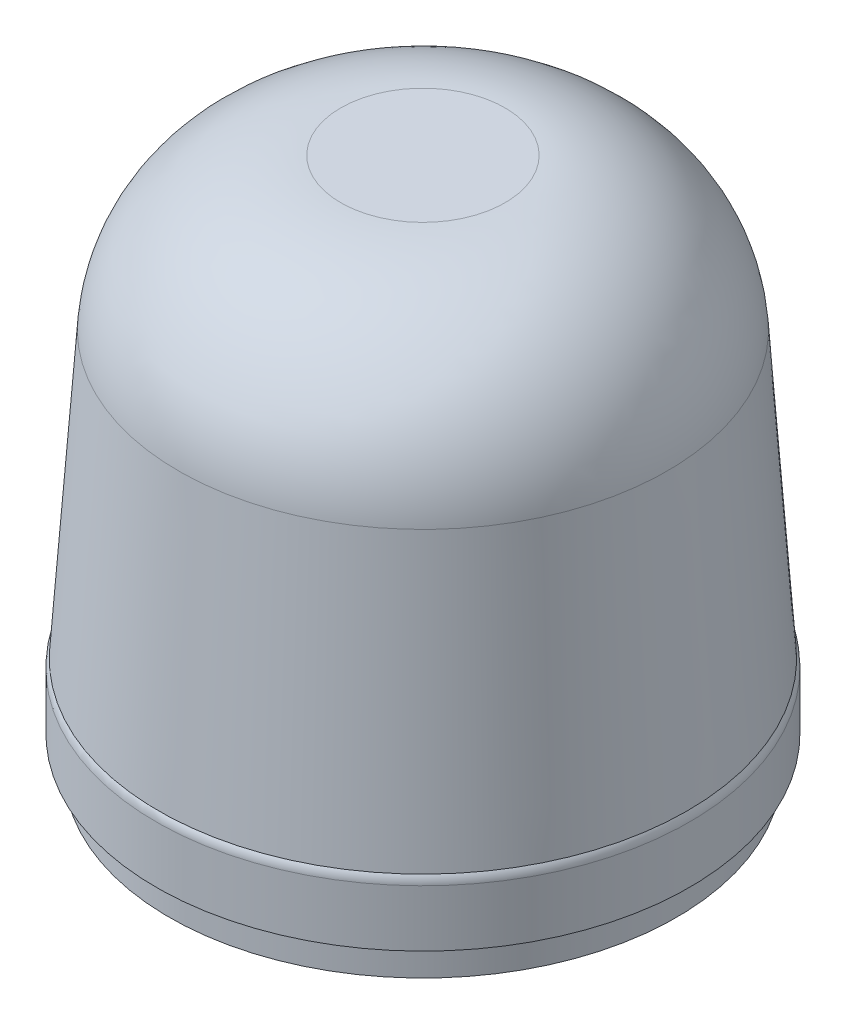
ISO-10303-21;
HEADER;
FILE_DESCRIPTION(('STEP AP214'),'2;1');
FILE_NAME('part.step','',(''),(''),'','','');
FILE_SCHEMA(('AUTOMOTIVE_DESIGN { 1 0 10303 214 1 1 1 1 }'));
ENDSEC;
DATA;
#1=APPLICATION_CONTEXT('core data for automotive mechanical design processes');
#2=APPLICATION_PROTOCOL_DEFINITION('international standard','automotive_design',2000,#1);
#3=PRODUCT_CONTEXT('',#1,'mechanical');
#4=PRODUCT('Part','Part','',(#3));
#5=PRODUCT_RELATED_PRODUCT_CATEGORY('part','',(#4));
#6=PRODUCT_DEFINITION_FORMATION('','',#4);
#7=PRODUCT_DEFINITION_CONTEXT('part definition',#1,'design');
#8=PRODUCT_DEFINITION('design','',#6,#7);
#9=PRODUCT_DEFINITION_SHAPE('','',#8);
#10=(LENGTH_UNIT() NAMED_UNIT(*) SI_UNIT(.MILLI.,.METRE.));
#11=(NAMED_UNIT(*) PLANE_ANGLE_UNIT() SI_UNIT($,.RADIAN.));
#12=(NAMED_UNIT(*) SI_UNIT($,.STERADIAN.) SOLID_ANGLE_UNIT());
#13=UNCERTAINTY_MEASURE_WITH_UNIT(LENGTH_MEASURE(1.E-05),#10,'distance_accuracy_value','');
#14=(GEOMETRIC_REPRESENTATION_CONTEXT(3) GLOBAL_UNCERTAINTY_ASSIGNED_CONTEXT((#13)) GLOBAL_UNIT_ASSIGNED_CONTEXT((#10,
#11,#12)) REPRESENTATION_CONTEXT('',''));
#15=CARTESIAN_POINT('',(0.,0.,0.));
#16=DIRECTION('',(0.,0.,1.));
#17=DIRECTION('',(1.,0.,0.));
#18=AXIS2_PLACEMENT_3D('',#15,#16,#17);
#19=CARTESIAN_POINT('',(0.,55.5209062741977,0.));
#20=DIRECTION('',(0.,-1.,0.));
#21=DIRECTION('',(1.,0.,0.));
#22=AXIS2_PLACEMENT_3D('',#19,#20,#21);
#23=PLANE('',#22);
#24=CARTESIAN_POINT('',(-6.86754675328633,55.5209062741977,14.7275015393456));
#25=DIRECTION('',(0.,-1.,0.));
#26=DIRECTION('',(0.,0.,-1.));
#27=AXIS2_PLACEMENT_3D('',#24,#25,#26);
#28=CIRCLE('',#27,0.625);
#29=CARTESIAN_POINT('',(-6.86754675328633,55.5209062741977,14.1025015393456));
#30=VERTEX_POINT('',#29);
#31=EDGE_CURVE('E88',#30,#30,#28,.T.);
#32=ORIENTED_EDGE('',*,*,#31,.F.);
#33=EDGE_LOOP('',(#32));
#34=FACE_BOUND('',#33,.T.);
#35=CARTESIAN_POINT('',(-9.32061709070447,55.5209062741977,-13.3112207196961));
#36=DIRECTION('',(0.,-1.,0.));
#37=DIRECTION('',(0.,0.,-1.));
#38=AXIS2_PLACEMENT_3D('',#35,#36,#37);
#39=CIRCLE('',#38,0.624999999999999);
#40=CARTESIAN_POINT('',(-9.32061709070447,55.5209062741977,-13.9362207196961));
#41=VERTEX_POINT('',#40);
#42=EDGE_CURVE('E87',#41,#41,#39,.T.);
#43=ORIENTED_EDGE('',*,*,#42,.F.);
#44=EDGE_LOOP('',(#43));
#45=FACE_BOUND('',#44,.T.);
#46=CARTESIAN_POINT('',(16.1881638439909,55.5209062741977,-1.41628081964933));
#47=DIRECTION('',(0.,-1.,0.));
#48=DIRECTION('',(0.,0.,-1.));
#49=AXIS2_PLACEMENT_3D('',#46,#47,#48);
#50=CIRCLE('',#49,0.625000000000001);
#51=CARTESIAN_POINT('',(16.1881638439909,55.5209062741977,-2.04128081964933));
#52=VERTEX_POINT('',#51);
#53=EDGE_CURVE('E101',#52,#52,#50,.T.);
#54=ORIENTED_EDGE('',*,*,#53,.F.);
#55=EDGE_LOOP('',(#54));
#56=FACE_BOUND('',#55,.T.);
#57=CARTESIAN_POINT('',(-6.71751442127228,55.5209062741977,-6.71751442127212));
#58=DIRECTION('',(0.,-1.,0.));
#59=DIRECTION('',(0.,0.,-1.));
#60=AXIS2_PLACEMENT_3D('',#57,#58,#59);
#61=CIRCLE('',#60,0.5);
#62=CARTESIAN_POINT('',(-6.71751442127228,55.5209062741977,-7.21751442127212));
#63=VERTEX_POINT('',#62);
#64=EDGE_CURVE('E109',#63,#63,#61,.T.);
#65=ORIENTED_EDGE('',*,*,#64,.F.);
#66=EDGE_LOOP('',(#65));
#67=FACE_BOUND('',#66,.T.);
#68=CARTESIAN_POINT('',(6.71751442127219,55.5209062741977,-6.71751442127221));
#69=DIRECTION('',(0.,-1.,0.));
#70=DIRECTION('',(0.,0.,-1.));
#71=AXIS2_PLACEMENT_3D('',#68,#69,#70);
#72=CIRCLE('',#71,0.5);
#73=CARTESIAN_POINT('',(6.71751442127219,55.5209062741977,-7.21751442127221));
#74=VERTEX_POINT('',#73);
#75=EDGE_CURVE('E117',#74,#74,#72,.T.);
#76=ORIENTED_EDGE('',*,*,#75,.F.);
#77=EDGE_LOOP('',(#76));
#78=FACE_BOUND('',#77,.T.);
#79=CARTESIAN_POINT('',(6.71751442127224,55.5209062741977,6.71751442127217));
#80=DIRECTION('',(0.,-1.,0.));
#81=DIRECTION('',(0.,0.,-1.));
#82=AXIS2_PLACEMENT_3D('',#79,#80,#81);
#83=CIRCLE('',#82,0.5);
#84=CARTESIAN_POINT('',(6.71751442127224,55.5209062741977,6.21751442127217));
#85=VERTEX_POINT('',#84);
#86=EDGE_CURVE('E125',#85,#85,#83,.T.);
#87=ORIENTED_EDGE('',*,*,#86,.F.);
#88=EDGE_LOOP('',(#87));
#89=FACE_BOUND('',#88,.T.);
#90=CARTESIAN_POINT('',(-6.71751442127219,55.5209062741977,6.71751442127221));
#91=DIRECTION('',(0.,-1.,0.));
#92=DIRECTION('',(0.,0.,-1.));
#93=AXIS2_PLACEMENT_3D('',#90,#91,#92);
#94=CIRCLE('',#93,0.5);
#95=CARTESIAN_POINT('',(-6.71751442127219,55.5209062741977,6.21751442127221));
#96=VERTEX_POINT('',#95);
#97=EDGE_CURVE('E133',#96,#96,#94,.T.);
#98=ORIENTED_EDGE('',*,*,#97,.F.);
#99=EDGE_LOOP('',(#98));
#100=FACE_BOUND('',#99,.T.);
#101=CARTESIAN_POINT('',(0.,55.5209062741977,0.));
#102=DIRECTION('',(0.,1.,0.));
#103=DIRECTION('',(-1.,0.,0.));
#104=AXIS2_PLACEMENT_3D('',#101,#102,#103);
#105=CIRCLE('',#104,19.5);
#106=CARTESIAN_POINT('',(-19.5,55.5209062741977,0.));
#107=VERTEX_POINT('',#106);
#108=EDGE_CURVE('E11',#107,#107,#105,.T.);
#109=ORIENTED_EDGE('',*,*,#108,.F.);
#110=EDGE_LOOP('',(#109));
#111=FACE_BOUND('',#110,.T.);
#112=ADVANCED_FACE('F46',(#34,#45,#56,#67,#78,#89,#100,#111),#23,.T.);
#113=CARTESIAN_POINT('',(0.,96.5209062741977,0.));
#114=DIRECTION('',(0.,1.,0.));
#115=DIRECTION('',(-1.,0.,0.));
#116=AXIS2_PLACEMENT_3D('',#113,#114,#115);
#117=CYLINDRICAL_SURFACE('',#116,19.5);
#118=ORIENTED_EDGE('',*,*,#108,.T.);
#119=EDGE_LOOP('',(#118));
#120=FACE_BOUND('',#119,.T.);
#121=CARTESIAN_POINT('',(0.,57.5209062741976,0.));
#122=DIRECTION('',(0.,1.,0.));
#123=DIRECTION('',(-1.,0.,0.));
#124=AXIS2_PLACEMENT_3D('',#121,#122,#123);
#125=CIRCLE('',#124,19.5);
#126=CARTESIAN_POINT('',(-19.5,57.5209062741976,0.));
#127=VERTEX_POINT('',#126);
#128=EDGE_CURVE('E54',#127,#127,#125,.T.);
#129=ORIENTED_EDGE('',*,*,#128,.F.);
#130=EDGE_LOOP('',(#129));
#131=FACE_BOUND('',#130,.T.);
#132=ADVANCED_FACE('F167',(#120,#131),#117,.T.);
#133=CARTESIAN_POINT('',(0.,58.0209062741976,0.));
#134=DIRECTION('',(0.,1.,0.));
#135=DIRECTION('',(-1.,0.,0.));
#136=AXIS2_PLACEMENT_3D('',#133,#134,#135);
#137=CONICAL_SURFACE('',#136,20.5,1.10714871779409);
#138=ORIENTED_EDGE('',*,*,#128,.T.);
#139=EDGE_LOOP('',(#138));
#140=FACE_BOUND('',#139,.T.);
#141=CARTESIAN_POINT('',(0.,58.0209062741976,0.));
#142=DIRECTION('',(0.,1.,0.));
#143=DIRECTION('',(-1.,0.,0.));
#144=AXIS2_PLACEMENT_3D('',#141,#142,#143);
#145=CIRCLE('',#144,20.5);
#146=CARTESIAN_POINT('',(-20.5,58.0209062741976,0.));
#147=VERTEX_POINT('',#146);
#148=EDGE_CURVE('E157',#147,#147,#145,.T.);
#149=ORIENTED_EDGE('',*,*,#148,.F.);
#150=EDGE_LOOP('',(#149));
#151=FACE_BOUND('',#150,.T.);
#152=ADVANCED_FACE('F164',(#140,#151),#137,.T.);
#153=CARTESIAN_POINT('',(0.,96.5209062741977,0.));
#154=DIRECTION('',(0.,1.,0.));
#155=DIRECTION('',(-1.,0.,0.));
#156=AXIS2_PLACEMENT_3D('',#153,#154,#155);
#157=CYLINDRICAL_SURFACE('',#156,20.5);
#158=ORIENTED_EDGE('',*,*,#148,.T.);
#159=EDGE_LOOP('',(#158));
#160=FACE_BOUND('',#159,.T.);
#161=CARTESIAN_POINT('',(0.,62.373158450448,0.));
#162=DIRECTION('',(0.,1.,0.));
#163=DIRECTION('',(-1.,0.,0.));
#164=AXIS2_PLACEMENT_3D('',#161,#162,#163);
#165=CIRCLE('',#164,20.5);
#166=CARTESIAN_POINT('',(-20.5,62.373158450448,0.));
#167=VERTEX_POINT('',#166);
#168=EDGE_CURVE('E153',#167,#167,#165,.T.);
#169=ORIENTED_EDGE('',*,*,#168,.F.);
#170=EDGE_LOOP('',(#169));
#171=FACE_BOUND('',#170,.T.);
#172=ADVANCED_FACE('F174',(#160,#171),#157,.T.);
#173=CARTESIAN_POINT('',(0.,62.373158450448,0.));
#174=DIRECTION('',(0.,1.,0.));
#175=DIRECTION('',(-1.,0.,0.));
#176=AXIS2_PLACEMENT_3D('',#173,#174,#175);
#177=TOROIDAL_SURFACE('',#176,19.25,1.25);
#178=ORIENTED_EDGE('',*,*,#168,.T.);
#179=EDGE_LOOP('',(#178));
#180=FACE_BOUND('',#179,.T.);
#181=CARTESIAN_POINT('',(0.,63.0209062741976,0.));
#182=DIRECTION('',(0.,1.,0.));
#183=DIRECTION('',(-1.,0.,0.));
#184=AXIS2_PLACEMENT_3D('',#181,#182,#183);
#185=CIRCLE('',#184,20.3190756553339);
#186=CARTESIAN_POINT('',(-20.3190756553339,63.0209062741976,0.));
#187=VERTEX_POINT('',#186);
#188=EDGE_CURVE('E149',#187,#187,#185,.T.);
#189=ORIENTED_EDGE('',*,*,#188,.F.);
#190=EDGE_LOOP('',(#189));
#191=FACE_BOUND('',#190,.T.);
#192=ADVANCED_FACE('F180',(#180,#191),#177,.T.);
#193=CARTESIAN_POINT('',(0.,84.8928621959991,0.));
#194=DIRECTION('',(0.,-1.,0.));
#195=DIRECTION('',(1.,0.,0.));
#196=AXIS2_PLACEMENT_3D('',#193,#194,#195);
#197=CONICAL_SURFACE('',#196,18.7896395067535,0.0698131700797651);
#198=ORIENTED_EDGE('',*,*,#188,.T.);
#199=EDGE_LOOP('',(#198));
#200=FACE_BOUND('',#199,.T.);
#201=CARTESIAN_POINT('',(0.,84.8928621959991,0.));
#202=DIRECTION('',(0.,1.,0.));
#203=DIRECTION('',(-1.,0.,0.));
#204=AXIS2_PLACEMENT_3D('',#201,#202,#203);
#205=CIRCLE('',#204,18.7896395067535);
#206=CARTESIAN_POINT('',(-18.7896395067535,84.8928621959991,0.));
#207=VERTEX_POINT('',#206);
#208=EDGE_CURVE('E145',#207,#207,#205,.T.);
#209=ORIENTED_EDGE('',*,*,#208,.F.);
#210=EDGE_LOOP('',(#209));
#211=FACE_BOUND('',#210,.T.);
#212=ADVANCED_FACE('F184',(#200,#211),#197,.T.);
#213=CARTESIAN_POINT('',(0.,84.0209062741977,0.));
#214=DIRECTION('',(0.,1.,0.));
#215=DIRECTION('',(-1.,0.,0.));
#216=AXIS2_PLACEMENT_3D('',#213,#214,#215);
#217=DEGENERATE_TOROIDAL_SURFACE('',#216,6.32008887850569,12.5,.T.);
#218=ORIENTED_EDGE('',*,*,#208,.T.);
#219=EDGE_LOOP('',(#218));
#220=FACE_BOUND('',#219,.T.);
#221=CARTESIAN_POINT('',(0.,96.5209062741977,0.));
#222=DIRECTION('',(0.,1.,0.));
#223=DIRECTION('',(-1.,0.,0.));
#224=AXIS2_PLACEMENT_3D('',#221,#222,#223);
#225=CIRCLE('',#224,6.32008887850569);
#226=CARTESIAN_POINT('',(-6.32008887850569,96.5209062741977,0.));
#227=VERTEX_POINT('',#226);
#228=EDGE_CURVE('E141',#227,#227,#225,.T.);
#229=ORIENTED_EDGE('',*,*,#228,.F.);
#230=EDGE_LOOP('',(#229));
#231=FACE_BOUND('',#230,.T.);
#232=ADVANCED_FACE('F188',(#220,#231),#217,.T.);
#233=CARTESIAN_POINT('',(-6.32008887850569,96.5209062741977,0.));
#234=DIRECTION('',(0.,1.,0.));
#235=DIRECTION('',(-1.,0.,0.));
#236=AXIS2_PLACEMENT_3D('',#233,#234,#235);
#237=PLANE('',#236);
#238=ORIENTED_EDGE('',*,*,#228,.T.);
#239=EDGE_LOOP('',(#238));
#240=FACE_BOUND('',#239,.T.);
#241=ADVANCED_FACE('F192',(#240),#237,.T.);
#242=CARTESIAN_POINT('',(-6.71751442127219,60.2709062741977,6.71751442127221));
#243=DIRECTION('',(0.,-1.,0.));
#244=DIRECTION('',(0.,0.,-1.));
#245=AXIS2_PLACEMENT_3D('',#242,#243,#244);
#246=CONICAL_SURFACE('',#245,0.499999999999999,1.02974425867665);
#247=CARTESIAN_POINT('',(-6.71751442127219,60.5713365837114,6.71751442127221));
#248=VERTEX_POINT('',#247);
#249=VERTEX_LOOP('',#248);
#250=FACE_BOUND('',#249,.T.);
#251=CARTESIAN_POINT('',(-6.71751442127219,60.2709062741977,6.71751442127221));
#252=DIRECTION('',(0.,-1.,0.));
#253=DIRECTION('',(0.,0.,-1.));
#254=AXIS2_PLACEMENT_3D('',#251,#252,#253);
#255=CIRCLE('',#254,0.499999999999999);
#256=CARTESIAN_POINT('',(-6.71751442127219,60.2709062741977,6.21751442127221));
#257=VERTEX_POINT('',#256);
#258=EDGE_CURVE('E137',#257,#257,#255,.T.);
#259=ORIENTED_EDGE('',*,*,#258,.T.);
#260=EDGE_LOOP('',(#259));
#261=FACE_BOUND('',#260,.T.);
#262=ADVANCED_FACE('F196',(#250,#261),#246,.F.);
#263=CARTESIAN_POINT('',(-6.71751442127219,55.5209062741977,6.71751442127221));
#264=DIRECTION('',(0.,-1.,0.));
#265=DIRECTION('',(0.,0.,-1.));
#266=AXIS2_PLACEMENT_3D('',#263,#264,#265);
#267=CYLINDRICAL_SURFACE('',#266,0.499999999999999);
#268=ORIENTED_EDGE('',*,*,#258,.F.);
#269=EDGE_LOOP('',(#268));
#270=FACE_BOUND('',#269,.T.);
#271=ORIENTED_EDGE('',*,*,#97,.T.);
#272=EDGE_LOOP('',(#271));
#273=FACE_BOUND('',#272,.T.);
#274=ADVANCED_FACE('F200',(#270,#273),#267,.F.);
#275=CARTESIAN_POINT('',(6.71751442127224,60.2709062741977,6.71751442127217));
#276=DIRECTION('',(0.,-1.,0.));
#277=DIRECTION('',(0.,0.,-1.));
#278=AXIS2_PLACEMENT_3D('',#275,#276,#277);
#279=CONICAL_SURFACE('',#278,0.499999999999999,1.02974425867665);
#280=CARTESIAN_POINT('',(6.71751442127224,60.5713365837114,6.71751442127217));
#281=VERTEX_POINT('',#280);
#282=VERTEX_LOOP('',#281);
#283=FACE_BOUND('',#282,.T.);
#284=CARTESIAN_POINT('',(6.71751442127224,60.2709062741977,6.71751442127217));
#285=DIRECTION('',(0.,-1.,0.));
#286=DIRECTION('',(0.,0.,-1.));
#287=AXIS2_PLACEMENT_3D('',#284,#285,#286);
#288=CIRCLE('',#287,0.499999999999999);
#289=CARTESIAN_POINT('',(6.71751442127224,60.2709062741977,6.21751442127217));
#290=VERTEX_POINT('',#289);
#291=EDGE_CURVE('E129',#290,#290,#288,.T.);
#292=ORIENTED_EDGE('',*,*,#291,.T.);
#293=EDGE_LOOP('',(#292));
#294=FACE_BOUND('',#293,.T.);
#295=ADVANCED_FACE('F203',(#283,#294),#279,.F.);
#296=CARTESIAN_POINT('',(6.71751442127224,55.5209062741977,6.71751442127217));
#297=DIRECTION('',(0.,-1.,0.));
#298=DIRECTION('',(0.,0.,-1.));
#299=AXIS2_PLACEMENT_3D('',#296,#297,#298);
#300=CYLINDRICAL_SURFACE('',#299,0.499999999999999);
#301=ORIENTED_EDGE('',*,*,#291,.F.);
#302=EDGE_LOOP('',(#301));
#303=FACE_BOUND('',#302,.T.);
#304=ORIENTED_EDGE('',*,*,#86,.T.);
#305=EDGE_LOOP('',(#304));
#306=FACE_BOUND('',#305,.T.);
#307=ADVANCED_FACE('F207',(#303,#306),#300,.F.);
#308=CARTESIAN_POINT('',(6.71751442127219,60.2709062741977,-6.71751442127221));
#309=DIRECTION('',(0.,-1.,0.));
#310=DIRECTION('',(0.,0.,-1.));
#311=AXIS2_PLACEMENT_3D('',#308,#309,#310);
#312=CONICAL_SURFACE('',#311,0.499999999999999,1.02974425867665);
#313=CARTESIAN_POINT('',(6.71751442127219,60.5713365837114,-6.71751442127221));
#314=VERTEX_POINT('',#313);
#315=VERTEX_LOOP('',#314);
#316=FACE_BOUND('',#315,.T.);
#317=CARTESIAN_POINT('',(6.71751442127219,60.2709062741977,-6.71751442127221));
#318=DIRECTION('',(0.,-1.,0.));
#319=DIRECTION('',(0.,0.,-1.));
#320=AXIS2_PLACEMENT_3D('',#317,#318,#319);
#321=CIRCLE('',#320,0.499999999999999);
#322=CARTESIAN_POINT('',(6.71751442127219,60.2709062741977,-7.21751442127221));
#323=VERTEX_POINT('',#322);
#324=EDGE_CURVE('E121',#323,#323,#321,.T.);
#325=ORIENTED_EDGE('',*,*,#324,.T.);
#326=EDGE_LOOP('',(#325));
#327=FACE_BOUND('',#326,.T.);
#328=ADVANCED_FACE('F210',(#316,#327),#312,.F.);
#329=CARTESIAN_POINT('',(6.71751442127219,55.5209062741977,-6.71751442127221));
#330=DIRECTION('',(0.,-1.,0.));
#331=DIRECTION('',(0.,0.,-1.));
#332=AXIS2_PLACEMENT_3D('',#329,#330,#331);
#333=CYLINDRICAL_SURFACE('',#332,0.499999999999999);
#334=ORIENTED_EDGE('',*,*,#324,.F.);
#335=EDGE_LOOP('',(#334));
#336=FACE_BOUND('',#335,.T.);
#337=ORIENTED_EDGE('',*,*,#75,.T.);
#338=EDGE_LOOP('',(#337));
#339=FACE_BOUND('',#338,.T.);
#340=ADVANCED_FACE('F214',(#336,#339),#333,.F.);
#341=CARTESIAN_POINT('',(-6.71751442127228,60.2709062741977,-6.71751442127212));
#342=DIRECTION('',(0.,-1.,0.));
#343=DIRECTION('',(0.,0.,-1.));
#344=AXIS2_PLACEMENT_3D('',#341,#342,#343);
#345=CONICAL_SURFACE('',#344,0.499999999999999,1.02974425867665);
#346=CARTESIAN_POINT('',(-6.71751442127229,60.5713365837114,-6.71751442127212));
#347=VERTEX_POINT('',#346);
#348=VERTEX_LOOP('',#347);
#349=FACE_BOUND('',#348,.T.);
#350=CARTESIAN_POINT('',(-6.71751442127228,60.2709062741977,-6.71751442127212));
#351=DIRECTION('',(0.,-1.,0.));
#352=DIRECTION('',(0.,0.,-1.));
#353=AXIS2_PLACEMENT_3D('',#350,#351,#352);
#354=CIRCLE('',#353,0.499999999999999);
#355=CARTESIAN_POINT('',(-6.71751442127228,60.2709062741977,-7.21751442127212));
#356=VERTEX_POINT('',#355);
#357=EDGE_CURVE('E113',#356,#356,#354,.T.);
#358=ORIENTED_EDGE('',*,*,#357,.T.);
#359=EDGE_LOOP('',(#358));
#360=FACE_BOUND('',#359,.T.);
#361=ADVANCED_FACE('F218',(#349,#360),#345,.F.);
#362=CARTESIAN_POINT('',(-6.71751442127228,55.5209062741977,-6.71751442127212));
#363=DIRECTION('',(0.,-1.,0.));
#364=DIRECTION('',(0.,0.,-1.));
#365=AXIS2_PLACEMENT_3D('',#362,#363,#364);
#366=CYLINDRICAL_SURFACE('',#365,0.499999999999999);
#367=ORIENTED_EDGE('',*,*,#357,.F.);
#368=EDGE_LOOP('',(#367));
#369=FACE_BOUND('',#368,.T.);
#370=ORIENTED_EDGE('',*,*,#64,.T.);
#371=EDGE_LOOP('',(#370));
#372=FACE_BOUND('',#371,.T.);
#373=ADVANCED_FACE('F222',(#369,#372),#366,.F.);
#374=CARTESIAN_POINT('',(16.1881638439909,60.2709062741977,-1.41628081964933));
#375=DIRECTION('',(0.,-1.,0.));
#376=DIRECTION('',(0.,0.,-1.));
#377=AXIS2_PLACEMENT_3D('',#374,#375,#376);
#378=CONICAL_SURFACE('',#377,0.625000000000001,1.02974425867665);
#379=CARTESIAN_POINT('',(16.1881638439909,60.6464441610899,-1.41628081964933));
#380=VERTEX_POINT('',#379);
#381=VERTEX_LOOP('',#380);
#382=FACE_BOUND('',#381,.T.);
#383=CARTESIAN_POINT('',(16.1881638439909,60.2709062741977,-1.41628081964933));
#384=DIRECTION('',(0.,-1.,0.));
#385=DIRECTION('',(0.,0.,-1.));
#386=AXIS2_PLACEMENT_3D('',#383,#384,#385);
#387=CIRCLE('',#386,0.625000000000001);
#388=CARTESIAN_POINT('',(16.1881638439909,60.2709062741977,-2.04128081964933));
#389=VERTEX_POINT('',#388);
#390=EDGE_CURVE('E105',#389,#389,#387,.T.);
#391=ORIENTED_EDGE('',*,*,#390,.T.);
#392=EDGE_LOOP('',(#391));
#393=FACE_BOUND('',#392,.T.);
#394=ADVANCED_FACE('F226',(#382,#393),#378,.F.);
#395=CARTESIAN_POINT('',(16.1881638439909,55.5209062741977,-1.41628081964933));
#396=DIRECTION('',(0.,-1.,0.));
#397=DIRECTION('',(0.,0.,-1.));
#398=AXIS2_PLACEMENT_3D('',#395,#396,#397);
#399=CYLINDRICAL_SURFACE('',#398,0.625000000000001);
#400=ORIENTED_EDGE('',*,*,#390,.F.);
#401=EDGE_LOOP('',(#400));
#402=FACE_BOUND('',#401,.T.);
#403=ORIENTED_EDGE('',*,*,#53,.T.);
#404=EDGE_LOOP('',(#403));
#405=FACE_BOUND('',#404,.T.);
#406=ADVANCED_FACE('F230',(#402,#405),#399,.F.);
#407=CARTESIAN_POINT('',(-9.32061709070447,60.2709062741977,-13.3112207196961));
#408=DIRECTION('',(0.,-1.,0.));
#409=DIRECTION('',(0.,0.,-1.));
#410=AXIS2_PLACEMENT_3D('',#407,#408,#409);
#411=CONICAL_SURFACE('',#410,0.624999999999999,1.02974425867665);
#412=CARTESIAN_POINT('',(-9.32061709070447,60.6464441610899,-13.3112207196961));
#413=VERTEX_POINT('',#412);
#414=VERTEX_LOOP('',#413);
#415=FACE_BOUND('',#414,.T.);
#416=CARTESIAN_POINT('',(-9.32061709070447,60.2709062741977,-13.3112207196961));
#417=DIRECTION('',(0.,-1.,0.));
#418=DIRECTION('',(0.,0.,-1.));
#419=AXIS2_PLACEMENT_3D('',#416,#417,#418);
#420=CIRCLE('',#419,0.624999999999999);
#421=CARTESIAN_POINT('',(-9.32061709070447,60.2709062741977,-13.9362207196961));
#422=VERTEX_POINT('',#421);
#423=EDGE_CURVE('E93',#422,#422,#420,.T.);
#424=ORIENTED_EDGE('',*,*,#423,.T.);
#425=EDGE_LOOP('',(#424));
#426=FACE_BOUND('',#425,.T.);
#427=ADVANCED_FACE('F234',(#415,#426),#411,.F.);
#428=CARTESIAN_POINT('',(-9.32061709070447,55.5209062741977,-13.3112207196961));
#429=DIRECTION('',(0.,-1.,0.));
#430=DIRECTION('',(0.,0.,-1.));
#431=AXIS2_PLACEMENT_3D('',#428,#429,#430);
#432=CYLINDRICAL_SURFACE('',#431,0.624999999999999);
#433=ORIENTED_EDGE('',*,*,#423,.F.);
#434=EDGE_LOOP('',(#433));
#435=FACE_BOUND('',#434,.T.);
#436=ORIENTED_EDGE('',*,*,#42,.T.);
#437=EDGE_LOOP('',(#436));
#438=FACE_BOUND('',#437,.T.);
#439=ADVANCED_FACE('F80',(#435,#438),#432,.F.);
#440=CARTESIAN_POINT('',(-6.86754675328633,60.2709062741977,14.7275015393456));
#441=DIRECTION('',(0.,-1.,0.));
#442=DIRECTION('',(0.,0.,-1.));
#443=AXIS2_PLACEMENT_3D('',#440,#441,#442);
#444=CONICAL_SURFACE('',#443,0.624999999999999,1.02974425867665);
#445=CARTESIAN_POINT('',(-6.86754675328633,60.6464441610899,14.7275015393456));
#446=VERTEX_POINT('',#445);
#447=VERTEX_LOOP('',#446);
#448=FACE_BOUND('',#447,.T.);
#449=CARTESIAN_POINT('',(-6.86754675328633,60.2709062741977,14.7275015393456));
#450=DIRECTION('',(0.,-1.,0.));
#451=DIRECTION('',(0.,0.,-1.));
#452=AXIS2_PLACEMENT_3D('',#449,#450,#451);
#453=CIRCLE('',#452,0.624999999999999);
#454=CARTESIAN_POINT('',(-6.86754675328633,60.2709062741977,14.1025015393456));
#455=VERTEX_POINT('',#454);
#456=EDGE_CURVE('E84',#455,#455,#453,.T.);
#457=ORIENTED_EDGE('',*,*,#456,.T.);
#458=EDGE_LOOP('',(#457));
#459=FACE_BOUND('',#458,.T.);
#460=ADVANCED_FACE('F76',(#448,#459),#444,.F.);
#461=CARTESIAN_POINT('',(-6.86754675328633,55.5209062741977,14.7275015393456));
#462=DIRECTION('',(0.,-1.,0.));
#463=DIRECTION('',(0.,0.,-1.));
#464=AXIS2_PLACEMENT_3D('',#461,#462,#463);
#465=CYLINDRICAL_SURFACE('',#464,0.624999999999999);
#466=ORIENTED_EDGE('',*,*,#456,.F.);
#467=EDGE_LOOP('',(#466));
#468=FACE_BOUND('',#467,.T.);
#469=ORIENTED_EDGE('',*,*,#31,.T.);
#470=EDGE_LOOP('',(#469));
#471=FACE_BOUND('',#470,.T.);
#472=ADVANCED_FACE('F79',(#468,#471),#465,.F.);
#473=CLOSED_SHELL('',(#112,#132,#152,#172,#192,#212,#232,#241,#262,#274,#295,#307,#328,#340,
#361,#373,#394,#406,#427,#439,#460,#472));
#474=MANIFOLD_SOLID_BREP('B2',#473);
#475=ADVANCED_BREP_SHAPE_REPRESENTATION('',(#18,#474),#14);
#476=SHAPE_DEFINITION_REPRESENTATION(#9,#475);
ENDSEC;
END-ISO-10303-21;
